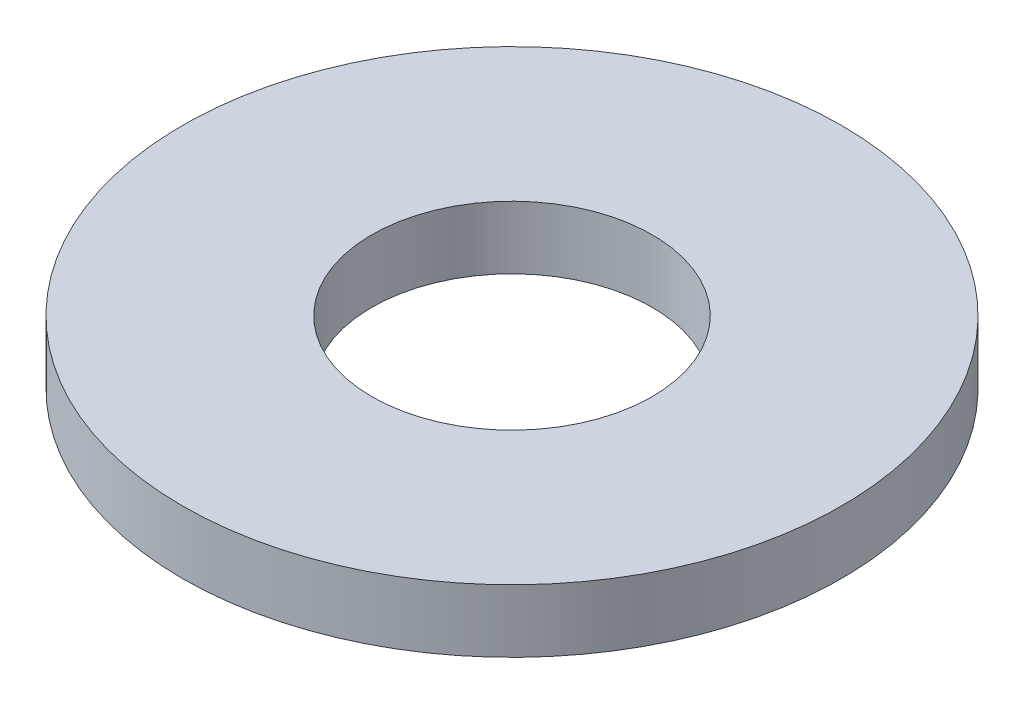
ISO-10303-21;
HEADER;
FILE_DESCRIPTION(('STEP AP214'),'2;1');
FILE_NAME('part.step','',(''),(''),'','','');
FILE_SCHEMA(('AUTOMOTIVE_DESIGN { 1 0 10303 214 1 1 1 1 }'));
ENDSEC;
DATA;
#1=APPLICATION_CONTEXT('core data for automotive mechanical design processes');
#2=APPLICATION_PROTOCOL_DEFINITION('international standard','automotive_design',2000,#1);
#3=PRODUCT_CONTEXT('',#1,'mechanical');
#4=PRODUCT('Part','Part','',(#3));
#5=PRODUCT_RELATED_PRODUCT_CATEGORY('part','',(#4));
#6=PRODUCT_DEFINITION_FORMATION('','',#4);
#7=PRODUCT_DEFINITION_CONTEXT('part definition',#1,'design');
#8=PRODUCT_DEFINITION('design','',#6,#7);
#9=PRODUCT_DEFINITION_SHAPE('','',#8);
#10=(LENGTH_UNIT() NAMED_UNIT(*) SI_UNIT(.MILLI.,.METRE.));
#11=(NAMED_UNIT(*) PLANE_ANGLE_UNIT() SI_UNIT($,.RADIAN.));
#12=(NAMED_UNIT(*) SI_UNIT($,.STERADIAN.) SOLID_ANGLE_UNIT());
#13=UNCERTAINTY_MEASURE_WITH_UNIT(LENGTH_MEASURE(1.E-05),#10,'distance_accuracy_value','');
#14=(GEOMETRIC_REPRESENTATION_CONTEXT(3) GLOBAL_UNCERTAINTY_ASSIGNED_CONTEXT((#13)) GLOBAL_UNIT_ASSIGNED_CONTEXT((#10,
#11,#12)) REPRESENTATION_CONTEXT('',''));
#15=CARTESIAN_POINT('',(0.,0.,0.));
#16=DIRECTION('',(0.,0.,1.));
#17=DIRECTION('',(1.,0.,0.));
#18=AXIS2_PLACEMENT_3D('',#15,#16,#17);
#19=CARTESIAN_POINT('',(0.,1.78,0.));
#20=DIRECTION('',(0.,1.,0.));
#21=DIRECTION('',(0.,0.,1.));
#22=AXIS2_PLACEMENT_3D('',#19,#20,#21);
#23=PLANE('',#22);
#24=CARTESIAN_POINT('',(0.,1.78,0.));
#25=DIRECTION('',(0.,1.,0.));
#26=DIRECTION('',(0.,0.,1.));
#27=AXIS2_PLACEMENT_3D('',#24,#25,#26);
#28=CIRCLE('',#27,9.3265625);
#29=CARTESIAN_POINT('',(0.,1.78,9.3265625));
#30=VERTEX_POINT('',#29);
#31=EDGE_CURVE('E10',#30,#30,#28,.T.);
#32=ORIENTED_EDGE('',*,*,#31,.T.);
#33=EDGE_LOOP('',(#32));
#34=FACE_BOUND('',#33,.T.);
#35=CARTESIAN_POINT('',(0.,1.78,0.));
#36=DIRECTION('',(0.,1.,0.));
#37=DIRECTION('',(0.,0.,1.));
#38=AXIS2_PLACEMENT_3D('',#35,#36,#37);
#39=CIRCLE('',#38,3.96875);
#40=CARTESIAN_POINT('',(0.,1.78,3.96875));
#41=VERTEX_POINT('',#40);
#42=EDGE_CURVE('E43',#41,#41,#39,.T.);
#43=ORIENTED_EDGE('',*,*,#42,.F.);
#44=EDGE_LOOP('',(#43));
#45=FACE_BOUND('',#44,.T.);
#46=ADVANCED_FACE('F32',(#34,#45),#23,.T.);
#47=CARTESIAN_POINT('',(0.,0.,0.));
#48=DIRECTION('',(0.,1.,0.));
#49=DIRECTION('',(0.,0.,1.));
#50=AXIS2_PLACEMENT_3D('',#47,#48,#49);
#51=PLANE('',#50);
#52=CARTESIAN_POINT('',(0.,0.,0.));
#53=DIRECTION('',(0.,1.,0.));
#54=DIRECTION('',(0.,0.,1.));
#55=AXIS2_PLACEMENT_3D('',#52,#53,#54);
#56=CIRCLE('',#55,9.3265625);
#57=CARTESIAN_POINT('',(0.,0.,9.3265625));
#58=VERTEX_POINT('',#57);
#59=EDGE_CURVE('E36',#58,#58,#56,.T.);
#60=ORIENTED_EDGE('',*,*,#59,.F.);
#61=EDGE_LOOP('',(#60));
#62=FACE_BOUND('',#61,.T.);
#63=CARTESIAN_POINT('',(0.,0.,0.));
#64=DIRECTION('',(0.,1.,0.));
#65=DIRECTION('',(0.,0.,1.));
#66=AXIS2_PLACEMENT_3D('',#63,#64,#65);
#67=CIRCLE('',#66,3.96875);
#68=CARTESIAN_POINT('',(0.,0.,3.96875));
#69=VERTEX_POINT('',#68);
#70=EDGE_CURVE('E45',#69,#69,#67,.T.);
#71=ORIENTED_EDGE('',*,*,#70,.T.);
#72=EDGE_LOOP('',(#71));
#73=FACE_BOUND('',#72,.T.);
#74=ADVANCED_FACE('F55',(#62,#73),#51,.F.);
#75=CARTESIAN_POINT('',(0.,1.78,0.));
#76=DIRECTION('',(0.,-1.,0.));
#77=DIRECTION('',(0.,0.,-1.));
#78=AXIS2_PLACEMENT_3D('',#75,#76,#77);
#79=CYLINDRICAL_SURFACE('',#78,9.3265625);
#80=ORIENTED_EDGE('',*,*,#31,.F.);
#81=EDGE_LOOP('',(#80));
#82=FACE_BOUND('',#81,.T.);
#83=ORIENTED_EDGE('',*,*,#59,.T.);
#84=EDGE_LOOP('',(#83));
#85=FACE_BOUND('',#84,.T.);
#86=ADVANCED_FACE('F34',(#82,#85),#79,.T.);
#87=CARTESIAN_POINT('',(0.,1.78,0.));
#88=DIRECTION('',(0.,-1.,0.));
#89=DIRECTION('',(0.,0.,-1.));
#90=AXIS2_PLACEMENT_3D('',#87,#88,#89);
#91=CYLINDRICAL_SURFACE('',#90,3.96875);
#92=ORIENTED_EDGE('',*,*,#42,.T.);
#93=EDGE_LOOP('',(#92));
#94=FACE_BOUND('',#93,.T.);
#95=ORIENTED_EDGE('',*,*,#70,.F.);
#96=EDGE_LOOP('',(#95));
#97=FACE_BOUND('',#96,.T.);
#98=ADVANCED_FACE('F51',(#94,#97),#91,.F.);
#99=CLOSED_SHELL('',(#46,#74,#86,#98));
#100=MANIFOLD_SOLID_BREP('B2',#99);
#101=ADVANCED_BREP_SHAPE_REPRESENTATION('',(#18,#100),#14);
#102=SHAPE_DEFINITION_REPRESENTATION(#9,#101);
ENDSEC;
END-ISO-10303-21;
